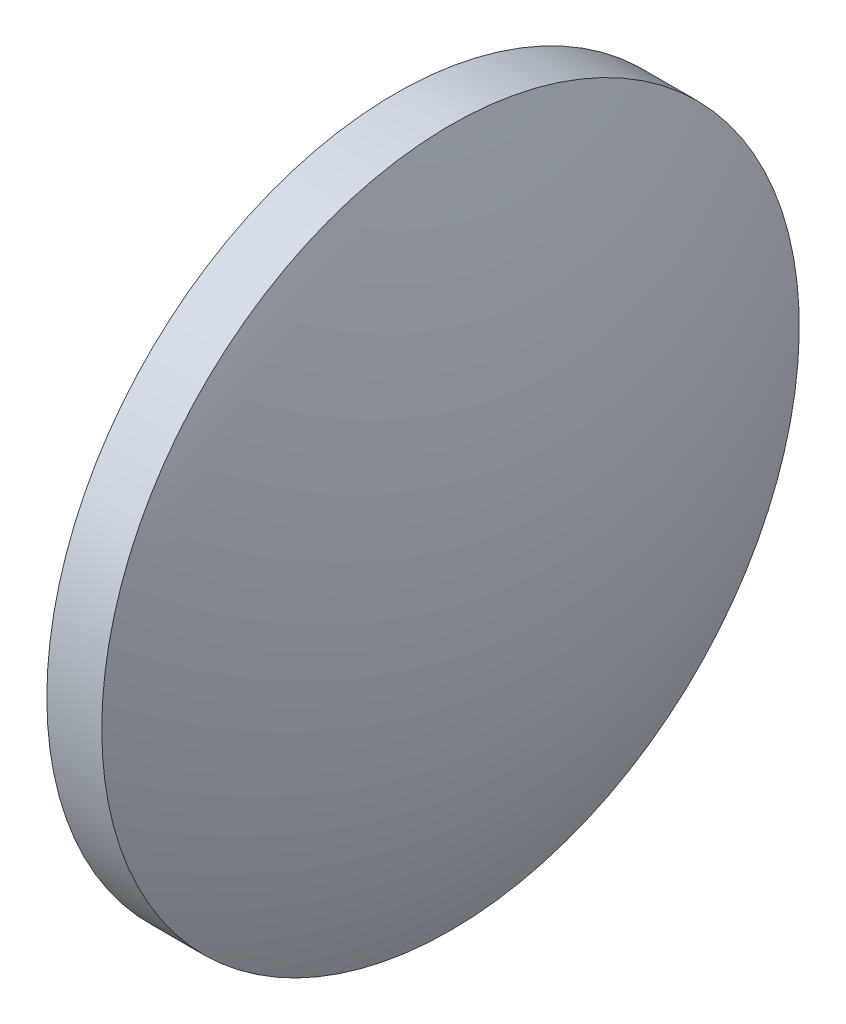
ISO-10303-21;
HEADER;
FILE_DESCRIPTION(('STEP AP214'),'2;1');
FILE_NAME('part.step','',(''),(''),'','','');
FILE_SCHEMA(('AUTOMOTIVE_DESIGN { 1 0 10303 214 1 1 1 1 }'));
ENDSEC;
DATA;
#1=APPLICATION_CONTEXT('core data for automotive mechanical design processes');
#2=APPLICATION_PROTOCOL_DEFINITION('international standard','automotive_design',2000,#1);
#3=PRODUCT_CONTEXT('',#1,'mechanical');
#4=PRODUCT('Part','Part','',(#3));
#5=PRODUCT_RELATED_PRODUCT_CATEGORY('part','',(#4));
#6=PRODUCT_DEFINITION_FORMATION('','',#4);
#7=PRODUCT_DEFINITION_CONTEXT('part definition',#1,'design');
#8=PRODUCT_DEFINITION('design','',#6,#7);
#9=PRODUCT_DEFINITION_SHAPE('','',#8);
#10=(LENGTH_UNIT() NAMED_UNIT(*) SI_UNIT(.MILLI.,.METRE.));
#11=(NAMED_UNIT(*) PLANE_ANGLE_UNIT() SI_UNIT($,.RADIAN.));
#12=(NAMED_UNIT(*) SI_UNIT($,.STERADIAN.) SOLID_ANGLE_UNIT());
#13=UNCERTAINTY_MEASURE_WITH_UNIT(LENGTH_MEASURE(1.E-05),#10,'distance_accuracy_value','');
#14=(GEOMETRIC_REPRESENTATION_CONTEXT(3) GLOBAL_UNCERTAINTY_ASSIGNED_CONTEXT((#13)) GLOBAL_UNIT_ASSIGNED_CONTEXT((#10,
#11,#12)) REPRESENTATION_CONTEXT('',''));
#15=CARTESIAN_POINT('',(0.,0.,0.));
#16=DIRECTION('',(0.,0.,1.));
#17=DIRECTION('',(1.,0.,0.));
#18=AXIS2_PLACEMENT_3D('',#15,#16,#17);
#19=CARTESIAN_POINT('',(407.327833908804,143.147734790025,0.));
#20=DIRECTION('',(-1.,0.,0.));
#21=DIRECTION('',(0.,-1.,0.));
#22=AXIS2_PLACEMENT_3D('',#19,#20,#21);
#23=SPHERICAL_SURFACE('',#22,32.3173076923078);
#24=CARTESIAN_POINT('',(437.045141601112,143.147734790025,0.));
#25=DIRECTION('',(-1.,0.,0.));
#26=DIRECTION('',(0.,0.,1.));
#27=AXIS2_PLACEMENT_3D('',#24,#25,#26);
#28=CIRCLE('',#27,12.7);
#29=CARTESIAN_POINT('',(437.045141601112,143.147734790025,12.7));
#30=VERTEX_POINT('',#29);
#31=EDGE_CURVE('E10',#30,#30,#28,.T.);
#32=ORIENTED_EDGE('',*,*,#31,.F.);
#33=EDGE_LOOP('',(#32));
#34=FACE_BOUND('',#33,.T.);
#35=ADVANCED_FACE('F35',(#34),#23,.T.);
#36=CARTESIAN_POINT('',(429.306923565436,143.147734790025,0.));
#37=DIRECTION('',(-1.,0.,0.));
#38=DIRECTION('',(0.,0.,1.));
#39=AXIS2_PLACEMENT_3D('',#36,#37,#38);
#40=CYLINDRICAL_SURFACE('',#39,12.7);
#41=CARTESIAN_POINT('',(435.045141601112,143.147734790025,0.));
#42=DIRECTION('',(-1.,0.,0.));
#43=DIRECTION('',(0.,0.,1.));
#44=AXIS2_PLACEMENT_3D('',#41,#42,#43);
#45=CIRCLE('',#44,12.7);
#46=CARTESIAN_POINT('',(435.045141601112,143.147734790025,12.7));
#47=VERTEX_POINT('',#46);
#48=EDGE_CURVE('E41',#47,#47,#45,.T.);
#49=ORIENTED_EDGE('',*,*,#48,.F.);
#50=EDGE_LOOP('',(#49));
#51=FACE_BOUND('',#50,.T.);
#52=ORIENTED_EDGE('',*,*,#31,.T.);
#53=EDGE_LOOP('',(#52));
#54=FACE_BOUND('',#53,.T.);
#55=ADVANCED_FACE('F49',(#51,#54),#40,.T.);
#56=CARTESIAN_POINT('',(435.045141601112,143.147734790025,0.));
#57=DIRECTION('',(1.,0.,0.));
#58=DIRECTION('',(0.,0.,-1.));
#59=AXIS2_PLACEMENT_3D('',#56,#57,#58);
#60=PLANE('',#59);
#61=ORIENTED_EDGE('',*,*,#48,.T.);
#62=EDGE_LOOP('',(#61));
#63=FACE_BOUND('',#62,.T.);
#64=ADVANCED_FACE('F47',(#63),#60,.F.);
#65=CLOSED_SHELL('',(#35,#55,#64));
#66=MANIFOLD_SOLID_BREP('B2',#65);
#67=ADVANCED_BREP_SHAPE_REPRESENTATION('',(#18,#66),#14);
#68=SHAPE_DEFINITION_REPRESENTATION(#9,#67);
ENDSEC;
END-ISO-10303-21;
